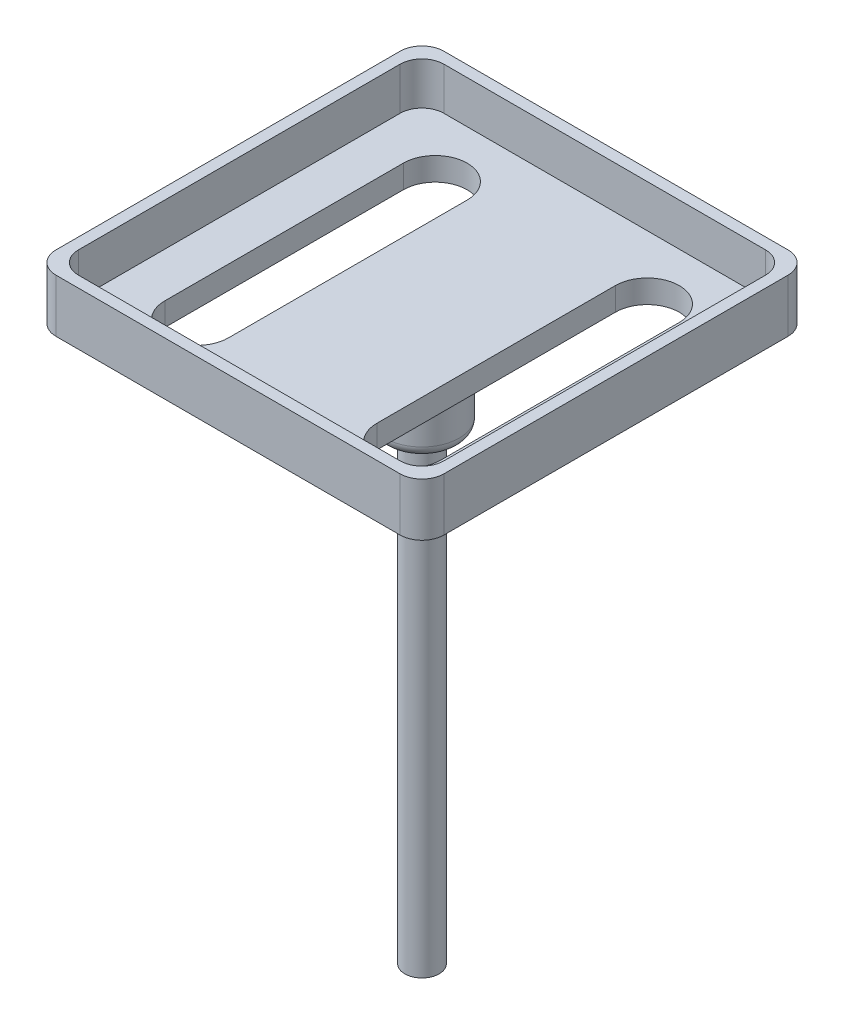
ISO-10303-21;
HEADER;
FILE_DESCRIPTION(('STEP AP214'),'2;1');
FILE_NAME('part.step','',(''),(''),'','','');
FILE_SCHEMA(('AUTOMOTIVE_DESIGN { 1 0 10303 214 1 1 1 1 }'));
ENDSEC;
DATA;
#1=APPLICATION_CONTEXT('core data for automotive mechanical design processes');
#2=APPLICATION_PROTOCOL_DEFINITION('international standard','automotive_design',2000,#1);
#3=PRODUCT_CONTEXT('',#1,'mechanical');
#4=PRODUCT('Part','Part','',(#3));
#5=PRODUCT_RELATED_PRODUCT_CATEGORY('part','',(#4));
#6=PRODUCT_DEFINITION_FORMATION('','',#4);
#7=PRODUCT_DEFINITION_CONTEXT('part definition',#1,'design');
#8=PRODUCT_DEFINITION('design','',#6,#7);
#9=PRODUCT_DEFINITION_SHAPE('','',#8);
#10=(LENGTH_UNIT() NAMED_UNIT(*) SI_UNIT(.MILLI.,.METRE.));
#11=(NAMED_UNIT(*) PLANE_ANGLE_UNIT() SI_UNIT($,.RADIAN.));
#12=(NAMED_UNIT(*) SI_UNIT($,.STERADIAN.) SOLID_ANGLE_UNIT());
#13=UNCERTAINTY_MEASURE_WITH_UNIT(LENGTH_MEASURE(1.E-05),#10,'distance_accuracy_value','');
#14=(GEOMETRIC_REPRESENTATION_CONTEXT(3) GLOBAL_UNCERTAINTY_ASSIGNED_CONTEXT((#13)) GLOBAL_UNIT_ASSIGNED_CONTEXT((#10,
#11,#12)) REPRESENTATION_CONTEXT('',''));
#15=CARTESIAN_POINT('',(0.,0.,0.));
#16=DIRECTION('',(0.,0.,1.));
#17=DIRECTION('',(1.,0.,0.));
#18=AXIS2_PLACEMENT_3D('',#15,#16,#17);
#19=CARTESIAN_POINT('',(0.,62.8904,0.));
#20=DIRECTION('',(0.,1.,0.));
#21=DIRECTION('',(0.,0.,1.));
#22=AXIS2_PLACEMENT_3D('',#19,#20,#21);
#23=PLANE('',#22);
#24=DIRECTION('',(-1.,0.,0.));
#25=VECTOR('',#24,1.);
#26=CARTESIAN_POINT('',(0.,62.8904,19.97075));
#27=LINE('',#26,#25);
#28=CARTESIAN_POINT('',(19.97075,62.8904,19.97075));
#29=VERTEX_POINT('',#28);
#30=CARTESIAN_POINT('',(-19.97075,62.8904,19.97075));
#31=VERTEX_POINT('',#30);
#32=EDGE_CURVE('E371',#29,#31,#27,.T.);
#33=ORIENTED_EDGE('',*,*,#32,.T.);
#34=DIRECTION('',(0.,0.,-1.));
#35=VECTOR('',#34,1.);
#36=CARTESIAN_POINT('',(-19.97075,62.8904,-19.97075));
#37=LINE('',#36,#35);
#38=CARTESIAN_POINT('',(-19.97075,62.8904,-19.97075));
#39=VERTEX_POINT('',#38);
#40=EDGE_CURVE('E373',#31,#39,#37,.T.);
#41=ORIENTED_EDGE('',*,*,#40,.T.);
#42=DIRECTION('',(1.,0.,0.));
#43=VECTOR('',#42,1.);
#44=CARTESIAN_POINT('',(19.97075,62.8904,-19.97075));
#45=LINE('',#44,#43);
#46=CARTESIAN_POINT('',(19.97075,62.8904,-19.97075));
#47=VERTEX_POINT('',#46);
#48=EDGE_CURVE('E367',#39,#47,#45,.T.);
#49=ORIENTED_EDGE('',*,*,#48,.T.);
#50=DIRECTION('',(0.,0.,1.));
#51=VECTOR('',#50,1.);
#52=CARTESIAN_POINT('',(19.97075,62.8904,0.));
#53=LINE('',#52,#51);
#54=EDGE_CURVE('E369',#47,#29,#53,.T.);
#55=ORIENTED_EDGE('',*,*,#54,.T.);
#56=EDGE_LOOP('',(#33,#41,#49,#55));
#57=FACE_BOUND('',#56,.T.);
#58=CARTESIAN_POINT('',(0.,62.8904,0.));
#59=DIRECTION('',(0.,1.,0.));
#60=DIRECTION('',(0.,0.,1.));
#61=AXIS2_PLACEMENT_3D('',#58,#59,#60);
#62=CIRCLE('',#61,6.858);
#63=CARTESIAN_POINT('',(0.,62.8904,6.858));
#64=VERTEX_POINT('',#63);
#65=EDGE_CURVE('E358',#64,#64,#62,.T.);
#66=ORIENTED_EDGE('',*,*,#65,.T.);
#67=EDGE_LOOP('',(#66));
#68=FACE_BOUND('',#67,.T.);
#69=CARTESIAN_POINT('',(-12.3063,62.8904,13.843));
#70=DIRECTION('',(0.,1.,0.));
#71=DIRECTION('',(0.,0.,1.));
#72=AXIS2_PLACEMENT_3D('',#69,#70,#71);
#73=CIRCLE('',#72,3.70840000000001);
#74=CARTESIAN_POINT('',(-16.0147,62.8904,13.843));
#75=VERTEX_POINT('',#74);
#76=CARTESIAN_POINT('',(-8.5979,62.8904,13.843));
#77=VERTEX_POINT('',#76);
#78=EDGE_CURVE('E212',#75,#77,#73,.T.);
#79=ORIENTED_EDGE('',*,*,#78,.T.);
#80=DIRECTION('',(0.,0.,1.));
#81=VECTOR('',#80,1.);
#82=CARTESIAN_POINT('',(-8.5979,62.8904,0.));
#83=LINE('',#82,#81);
#84=CARTESIAN_POINT('',(-8.5979,62.8904,-13.843));
#85=VERTEX_POINT('',#84);
#86=EDGE_CURVE('E257',#85,#77,#83,.T.);
#87=ORIENTED_EDGE('',*,*,#86,.F.);
#88=CARTESIAN_POINT('',(-12.3063,62.8904,-13.843));
#89=DIRECTION('',(0.,1.,0.));
#90=DIRECTION('',(0.,0.,1.));
#91=AXIS2_PLACEMENT_3D('',#88,#89,#90);
#92=CIRCLE('',#91,3.7084);
#93=CARTESIAN_POINT('',(-16.0147,62.8904,-13.843));
#94=VERTEX_POINT('',#93);
#95=EDGE_CURVE('E254',#85,#94,#92,.T.);
#96=ORIENTED_EDGE('',*,*,#95,.T.);
#97=DIRECTION('',(0.,0.,1.));
#98=VECTOR('',#97,1.);
#99=CARTESIAN_POINT('',(-16.0147,62.8904,0.));
#100=LINE('',#99,#98);
#101=EDGE_CURVE('E251',#94,#75,#100,.T.);
#102=ORIENTED_EDGE('',*,*,#101,.T.);
#103=EDGE_LOOP('',(#79,#87,#96,#102));
#104=FACE_BOUND('',#103,.T.);
#105=DIRECTION('',(0.,0.,1.));
#106=VECTOR('',#105,1.);
#107=CARTESIAN_POINT('',(16.0147,62.8904,0.));
#108=LINE('',#107,#106);
#109=CARTESIAN_POINT('',(16.0147,62.8904,-13.843));
#110=VERTEX_POINT('',#109);
#111=CARTESIAN_POINT('',(16.0147,62.8904,13.843));
#112=VERTEX_POINT('',#111);
#113=EDGE_CURVE('E260',#110,#112,#108,.T.);
#114=ORIENTED_EDGE('',*,*,#113,.F.);
#115=CARTESIAN_POINT('',(12.3063,62.8904,-13.843));
#116=DIRECTION('',(0.,1.,0.));
#117=DIRECTION('',(0.,0.,1.));
#118=AXIS2_PLACEMENT_3D('',#115,#116,#117);
#119=CIRCLE('',#118,3.7084);
#120=CARTESIAN_POINT('',(8.5979,62.8904,-13.843));
#121=VERTEX_POINT('',#120);
#122=EDGE_CURVE('E269',#121,#110,#119,.F.);
#123=ORIENTED_EDGE('',*,*,#122,.F.);
#124=DIRECTION('',(0.,0.,1.));
#125=VECTOR('',#124,1.);
#126=CARTESIAN_POINT('',(8.5979,62.8904,0.));
#127=LINE('',#126,#125);
#128=CARTESIAN_POINT('',(8.5979,62.8904,13.843));
#129=VERTEX_POINT('',#128);
#130=EDGE_CURVE('E266',#121,#129,#127,.T.);
#131=ORIENTED_EDGE('',*,*,#130,.T.);
#132=CARTESIAN_POINT('',(12.3063,62.8904,13.843));
#133=DIRECTION('',(0.,1.,0.));
#134=DIRECTION('',(0.,0.,1.));
#135=AXIS2_PLACEMENT_3D('',#132,#133,#134);
#136=CIRCLE('',#135,3.70840000000001);
#137=EDGE_CURVE('E263',#112,#129,#136,.F.);
#138=ORIENTED_EDGE('',*,*,#137,.F.);
#139=EDGE_LOOP('',(#114,#123,#131,#138));
#140=FACE_BOUND('',#139,.T.);
#141=ADVANCED_FACE('F33',(#57,#68,#104,#140),#23,.F.);
#142=CARTESIAN_POINT('',(16.0147,65.5701,0.));
#143=DIRECTION('',(1.,0.,0.));
#144=DIRECTION('',(0.,0.,-1.));
#145=AXIS2_PLACEMENT_3D('',#142,#143,#144);
#146=PLANE('',#145);
#147=ORIENTED_EDGE('',*,*,#113,.T.);
#148=DIRECTION('',(0.,-1.,0.));
#149=VECTOR('',#148,1.);
#150=CARTESIAN_POINT('',(16.0147,65.5701,13.843));
#151=LINE('',#150,#149);
#152=CARTESIAN_POINT('',(16.0147,65.5701,13.843));
#153=VERTEX_POINT('',#152);
#154=EDGE_CURVE('E278',#153,#112,#151,.T.);
#155=ORIENTED_EDGE('',*,*,#154,.F.);
#156=DIRECTION('',(0.,0.,1.));
#157=VECTOR('',#156,1.);
#158=CARTESIAN_POINT('',(16.0147,65.5701,0.));
#159=LINE('',#158,#157);
#160=CARTESIAN_POINT('',(16.0147,65.5701,-13.843));
#161=VERTEX_POINT('',#160);
#162=EDGE_CURVE('E239',#161,#153,#159,.T.);
#163=ORIENTED_EDGE('',*,*,#162,.F.);
#164=DIRECTION('',(0.,-1.,0.));
#165=VECTOR('',#164,1.);
#166=CARTESIAN_POINT('',(16.0147,65.5701,-13.843));
#167=LINE('',#166,#165);
#168=EDGE_CURVE('E217',#161,#110,#167,.T.);
#169=ORIENTED_EDGE('',*,*,#168,.T.);
#170=EDGE_LOOP('',(#147,#155,#163,#169));
#171=FACE_BOUND('',#170,.T.);
#172=ADVANCED_FACE('F514',(#171),#146,.F.);
#173=CARTESIAN_POINT('',(12.3063,65.5701,13.843));
#174=DIRECTION('',(0.,-1.,0.));
#175=DIRECTION('',(0.,0.,-1.));
#176=AXIS2_PLACEMENT_3D('',#173,#174,#175);
#177=CYLINDRICAL_SURFACE('',#176,3.70840000000001);
#178=ORIENTED_EDGE('',*,*,#137,.T.);
#179=DIRECTION('',(0.,-1.,0.));
#180=VECTOR('',#179,1.);
#181=CARTESIAN_POINT('',(8.5979,65.5701,13.843));
#182=LINE('',#181,#180);
#183=CARTESIAN_POINT('',(8.5979,65.5701,13.843));
#184=VERTEX_POINT('',#183);
#185=EDGE_CURVE('E276',#184,#129,#182,.T.);
#186=ORIENTED_EDGE('',*,*,#185,.F.);
#187=CARTESIAN_POINT('',(12.3063,65.5701,13.843));
#188=DIRECTION('',(0.,1.,0.));
#189=DIRECTION('',(0.,0.,1.));
#190=AXIS2_PLACEMENT_3D('',#187,#188,#189);
#191=CIRCLE('',#190,3.70840000000001);
#192=EDGE_CURVE('E242',#153,#184,#191,.F.);
#193=ORIENTED_EDGE('',*,*,#192,.F.);
#194=ORIENTED_EDGE('',*,*,#154,.T.);
#195=EDGE_LOOP('',(#178,#186,#193,#194));
#196=FACE_BOUND('',#195,.T.);
#197=ADVANCED_FACE('F519',(#196),#177,.F.);
#198=CARTESIAN_POINT('',(8.5979,65.5701,0.));
#199=DIRECTION('',(1.,0.,0.));
#200=DIRECTION('',(0.,0.,-1.));
#201=AXIS2_PLACEMENT_3D('',#198,#199,#200);
#202=PLANE('',#201);
#203=ORIENTED_EDGE('',*,*,#130,.F.);
#204=DIRECTION('',(0.,-1.,0.));
#205=VECTOR('',#204,1.);
#206=CARTESIAN_POINT('',(8.5979,65.5701,-13.843));
#207=LINE('',#206,#205);
#208=CARTESIAN_POINT('',(8.5979,65.5701,-13.843));
#209=VERTEX_POINT('',#208);
#210=EDGE_CURVE('E274',#209,#121,#207,.T.);
#211=ORIENTED_EDGE('',*,*,#210,.F.);
#212=DIRECTION('',(0.,0.,1.));
#213=VECTOR('',#212,1.);
#214=CARTESIAN_POINT('',(8.5979,65.5701,0.));
#215=LINE('',#214,#213);
#216=EDGE_CURVE('E244',#209,#184,#215,.T.);
#217=ORIENTED_EDGE('',*,*,#216,.T.);
#218=ORIENTED_EDGE('',*,*,#185,.T.);
#219=EDGE_LOOP('',(#203,#211,#217,#218));
#220=FACE_BOUND('',#219,.T.);
#221=ADVANCED_FACE('F524',(#220),#202,.T.);
#222=CARTESIAN_POINT('',(-12.3063,65.5701,13.843));
#223=DIRECTION('',(0.,-1.,0.));
#224=DIRECTION('',(0.,0.,-1.));
#225=AXIS2_PLACEMENT_3D('',#222,#223,#224);
#226=CYLINDRICAL_SURFACE('',#225,3.70840000000001);
#227=ORIENTED_EDGE('',*,*,#78,.F.);
#228=DIRECTION('',(0.,-1.,0.));
#229=VECTOR('',#228,1.);
#230=CARTESIAN_POINT('',(-16.0147,65.5701,13.843));
#231=LINE('',#230,#229);
#232=CARTESIAN_POINT('',(-16.0147,65.5701,13.843));
#233=VERTEX_POINT('',#232);
#234=EDGE_CURVE('E207',#233,#75,#231,.T.);
#235=ORIENTED_EDGE('',*,*,#234,.F.);
#236=CARTESIAN_POINT('',(-12.3063,65.5701,13.843));
#237=DIRECTION('',(0.,1.,0.));
#238=DIRECTION('',(0.,0.,1.));
#239=AXIS2_PLACEMENT_3D('',#236,#237,#238);
#240=CIRCLE('',#239,3.70840000000001);
#241=CARTESIAN_POINT('',(-8.5979,65.5701,13.843));
#242=VERTEX_POINT('',#241);
#243=EDGE_CURVE('E210',#233,#242,#240,.T.);
#244=ORIENTED_EDGE('',*,*,#243,.T.);
#245=DIRECTION('',(0.,-1.,0.));
#246=VECTOR('',#245,1.);
#247=CARTESIAN_POINT('',(-8.5979,65.5701,13.843));
#248=LINE('',#247,#246);
#249=EDGE_CURVE('E249',#242,#77,#248,.T.);
#250=ORIENTED_EDGE('',*,*,#249,.T.);
#251=EDGE_LOOP('',(#227,#235,#244,#250));
#252=FACE_BOUND('',#251,.T.);
#253=ADVANCED_FACE('F209',(#252),#226,.F.);
#254=CARTESIAN_POINT('',(-16.0147,65.5701,0.));
#255=DIRECTION('',(1.,0.,0.));
#256=DIRECTION('',(0.,0.,-1.));
#257=AXIS2_PLACEMENT_3D('',#254,#255,#256);
#258=PLANE('',#257);
#259=ORIENTED_EDGE('',*,*,#101,.F.);
#260=DIRECTION('',(0.,-1.,0.));
#261=VECTOR('',#260,1.);
#262=CARTESIAN_POINT('',(-16.0147,65.5701,-13.843));
#263=LINE('',#262,#261);
#264=CARTESIAN_POINT('',(-16.0147,65.5701,-13.843));
#265=VERTEX_POINT('',#264);
#266=EDGE_CURVE('E218',#265,#94,#263,.T.);
#267=ORIENTED_EDGE('',*,*,#266,.F.);
#268=DIRECTION('',(0.,0.,1.));
#269=VECTOR('',#268,1.);
#270=CARTESIAN_POINT('',(-16.0147,65.5701,0.));
#271=LINE('',#270,#269);
#272=EDGE_CURVE('E225',#265,#233,#271,.T.);
#273=ORIENTED_EDGE('',*,*,#272,.T.);
#274=ORIENTED_EDGE('',*,*,#234,.T.);
#275=EDGE_LOOP('',(#259,#267,#273,#274));
#276=FACE_BOUND('',#275,.T.);
#277=ADVANCED_FACE('F232',(#276),#258,.T.);
#278=CARTESIAN_POINT('',(-12.3063,65.5701,-13.843));
#279=DIRECTION('',(0.,-1.,0.));
#280=DIRECTION('',(0.,0.,-1.));
#281=AXIS2_PLACEMENT_3D('',#278,#279,#280);
#282=CYLINDRICAL_SURFACE('',#281,3.7084);
#283=ORIENTED_EDGE('',*,*,#95,.F.);
#284=DIRECTION('',(0.,-1.,0.));
#285=VECTOR('',#284,1.);
#286=CARTESIAN_POINT('',(-8.5979,65.5701,-13.843));
#287=LINE('',#286,#285);
#288=CARTESIAN_POINT('',(-8.5979,65.5701,-13.843));
#289=VERTEX_POINT('',#288);
#290=EDGE_CURVE('E283',#289,#85,#287,.T.);
#291=ORIENTED_EDGE('',*,*,#290,.F.);
#292=CARTESIAN_POINT('',(-12.3063,65.5701,-13.843));
#293=DIRECTION('',(0.,1.,0.));
#294=DIRECTION('',(0.,0.,1.));
#295=AXIS2_PLACEMENT_3D('',#292,#293,#294);
#296=CIRCLE('',#295,3.7084);
#297=EDGE_CURVE('E233',#289,#265,#296,.T.);
#298=ORIENTED_EDGE('',*,*,#297,.T.);
#299=ORIENTED_EDGE('',*,*,#266,.T.);
#300=EDGE_LOOP('',(#283,#291,#298,#299));
#301=FACE_BOUND('',#300,.T.);
#302=ADVANCED_FACE('F533',(#301),#282,.F.);
#303=CARTESIAN_POINT('',(-8.5979,65.5701,0.));
#304=DIRECTION('',(1.,0.,0.));
#305=DIRECTION('',(0.,0.,-1.));
#306=AXIS2_PLACEMENT_3D('',#303,#304,#305);
#307=PLANE('',#306);
#308=ORIENTED_EDGE('',*,*,#86,.T.);
#309=ORIENTED_EDGE('',*,*,#249,.F.);
#310=DIRECTION('',(0.,0.,1.));
#311=VECTOR('',#310,1.);
#312=CARTESIAN_POINT('',(-8.5979,65.5701,0.));
#313=LINE('',#312,#311);
#314=EDGE_CURVE('E228',#289,#242,#313,.T.);
#315=ORIENTED_EDGE('',*,*,#314,.F.);
#316=ORIENTED_EDGE('',*,*,#290,.T.);
#317=EDGE_LOOP('',(#308,#309,#315,#316));
#318=FACE_BOUND('',#317,.T.);
#319=ADVANCED_FACE('F508',(#318),#307,.F.);
#320=CARTESIAN_POINT('',(12.3063,65.5701,-13.843));
#321=DIRECTION('',(0.,-1.,0.));
#322=DIRECTION('',(0.,0.,-1.));
#323=AXIS2_PLACEMENT_3D('',#320,#321,#322);
#324=CYLINDRICAL_SURFACE('',#323,3.7084);
#325=ORIENTED_EDGE('',*,*,#122,.T.);
#326=ORIENTED_EDGE('',*,*,#168,.F.);
#327=CARTESIAN_POINT('',(12.3063,65.5701,-13.843));
#328=DIRECTION('',(0.,1.,0.));
#329=DIRECTION('',(0.,0.,1.));
#330=AXIS2_PLACEMENT_3D('',#327,#328,#329);
#331=CIRCLE('',#330,3.7084);
#332=EDGE_CURVE('E247',#209,#161,#331,.F.);
#333=ORIENTED_EDGE('',*,*,#332,.F.);
#334=ORIENTED_EDGE('',*,*,#210,.T.);
#335=EDGE_LOOP('',(#325,#326,#333,#334));
#336=FACE_BOUND('',#335,.T.);
#337=ADVANCED_FACE('F501',(#336),#324,.F.);
#338=CARTESIAN_POINT('',(0.,65.5701,0.));
#339=DIRECTION('',(0.,1.,0.));
#340=DIRECTION('',(0.,0.,1.));
#341=AXIS2_PLACEMENT_3D('',#338,#339,#340);
#342=PLANE('',#341);
#343=DIRECTION('',(1.,0.,0.));
#344=VECTOR('',#343,1.);
#345=CARTESIAN_POINT('',(0.,65.5701,21.209));
#346=LINE('',#345,#344);
#347=CARTESIAN_POINT('',(-18.669,65.5701,21.209));
#348=VERTEX_POINT('',#347);
#349=CARTESIAN_POINT('',(18.669,65.5701,21.209));
#350=VERTEX_POINT('',#349);
#351=EDGE_CURVE('E457',#348,#350,#346,.T.);
#352=ORIENTED_EDGE('',*,*,#351,.T.);
#353=CARTESIAN_POINT('',(18.669,65.5701,18.669));
#354=DIRECTION('',(0.,1.,0.));
#355=DIRECTION('',(0.,0.,1.));
#356=AXIS2_PLACEMENT_3D('',#353,#354,#355);
#357=CIRCLE('',#356,2.54);
#358=CARTESIAN_POINT('',(21.209,65.5701,18.669));
#359=VERTEX_POINT('',#358);
#360=EDGE_CURVE('E299',#350,#359,#357,.T.);
#361=ORIENTED_EDGE('',*,*,#360,.T.);
#362=DIRECTION('',(0.,0.,-1.));
#363=VECTOR('',#362,1.);
#364=CARTESIAN_POINT('',(21.209,65.5701,0.));
#365=LINE('',#364,#363);
#366=CARTESIAN_POINT('',(21.209,65.5701,-18.669));
#367=VERTEX_POINT('',#366);
#368=EDGE_CURVE('E460',#359,#367,#365,.T.);
#369=ORIENTED_EDGE('',*,*,#368,.T.);
#370=CARTESIAN_POINT('',(18.669,65.5701,-18.669));
#371=DIRECTION('',(0.,1.,0.));
#372=DIRECTION('',(0.,0.,1.));
#373=AXIS2_PLACEMENT_3D('',#370,#371,#372);
#374=CIRCLE('',#373,2.54);
#375=CARTESIAN_POINT('',(18.669,65.5701,-21.209));
#376=VERTEX_POINT('',#375);
#377=EDGE_CURVE('E297',#367,#376,#374,.T.);
#378=ORIENTED_EDGE('',*,*,#377,.T.);
#379=DIRECTION('',(1.,0.,0.));
#380=VECTOR('',#379,1.);
#381=CARTESIAN_POINT('',(0.,65.5701,-21.209));
#382=LINE('',#381,#380);
#383=CARTESIAN_POINT('',(-18.669,65.5701,-21.209));
#384=VERTEX_POINT('',#383);
#385=EDGE_CURVE('E230',#384,#376,#382,.T.);
#386=ORIENTED_EDGE('',*,*,#385,.F.);
#387=CARTESIAN_POINT('',(-18.669,65.5701,-18.669));
#388=DIRECTION('',(0.,1.,0.));
#389=DIRECTION('',(0.,0.,1.));
#390=AXIS2_PLACEMENT_3D('',#387,#388,#389);
#391=CIRCLE('',#390,2.54);
#392=CARTESIAN_POINT('',(-21.209,65.5701,-18.669));
#393=VERTEX_POINT('',#392);
#394=EDGE_CURVE('E295',#384,#393,#391,.T.);
#395=ORIENTED_EDGE('',*,*,#394,.T.);
#396=DIRECTION('',(0.,0.,-1.));
#397=VECTOR('',#396,1.);
#398=CARTESIAN_POINT('',(-21.209,65.5701,0.));
#399=LINE('',#398,#397);
#400=CARTESIAN_POINT('',(-21.209,65.5701,18.669));
#401=VERTEX_POINT('',#400);
#402=EDGE_CURVE('E271',#401,#393,#399,.T.);
#403=ORIENTED_EDGE('',*,*,#402,.F.);
#404=CARTESIAN_POINT('',(-18.669,65.5701,18.669));
#405=DIRECTION('',(0.,1.,0.));
#406=DIRECTION('',(0.,0.,1.));
#407=AXIS2_PLACEMENT_3D('',#404,#405,#406);
#408=CIRCLE('',#407,2.54);
#409=EDGE_CURVE('E293',#401,#348,#408,.T.);
#410=ORIENTED_EDGE('',*,*,#409,.T.);
#411=EDGE_LOOP('',(#352,#361,#369,#378,#386,#395,#403,#410));
#412=FACE_BOUND('',#411,.T.);
#413=ORIENTED_EDGE('',*,*,#243,.F.);
#414=ORIENTED_EDGE('',*,*,#272,.F.);
#415=ORIENTED_EDGE('',*,*,#297,.F.);
#416=ORIENTED_EDGE('',*,*,#314,.T.);
#417=EDGE_LOOP('',(#413,#414,#415,#416));
#418=FACE_BOUND('',#417,.T.);
#419=ORIENTED_EDGE('',*,*,#162,.T.);
#420=ORIENTED_EDGE('',*,*,#192,.T.);
#421=ORIENTED_EDGE('',*,*,#216,.F.);
#422=ORIENTED_EDGE('',*,*,#332,.T.);
#423=EDGE_LOOP('',(#419,#420,#421,#422));
#424=FACE_BOUND('',#423,.T.);
#425=ADVANCED_FACE('F222',(#412,#418,#424),#342,.T.);
#426=CARTESIAN_POINT('',(0.,70.5104,21.209));
#427=DIRECTION('',(0.,0.,-1.));
#428=DIRECTION('',(-1.,0.,0.));
#429=AXIS2_PLACEMENT_3D('',#426,#427,#428);
#430=PLANE('',#429);
#431=DIRECTION('',(1.,0.,0.));
#432=VECTOR('',#431,1.);
#433=CARTESIAN_POINT('',(0.,70.5104,21.209));
#434=LINE('',#433,#432);
#435=CARTESIAN_POINT('',(-18.669,70.5104,21.209));
#436=VERTEX_POINT('',#435);
#437=CARTESIAN_POINT('',(18.669,70.5104,21.209));
#438=VERTEX_POINT('',#437);
#439=EDGE_CURVE('E440',#436,#438,#434,.T.);
#440=ORIENTED_EDGE('',*,*,#439,.T.);
#441=DIRECTION('',(0.,-1.,0.));
#442=VECTOR('',#441,1.);
#443=CARTESIAN_POINT('',(18.669,65.5701,21.209));
#444=LINE('',#443,#442);
#445=EDGE_CURVE('E290',#438,#350,#444,.T.);
#446=ORIENTED_EDGE('',*,*,#445,.T.);
#447=ORIENTED_EDGE('',*,*,#351,.F.);
#448=DIRECTION('',(0.,-1.,0.));
#449=VECTOR('',#448,1.);
#450=CARTESIAN_POINT('',(-18.669,70.5104,21.209));
#451=LINE('',#450,#449);
#452=EDGE_CURVE('E288',#348,#436,#451,.F.);
#453=ORIENTED_EDGE('',*,*,#452,.T.);
#454=EDGE_LOOP('',(#440,#446,#447,#453));
#455=FACE_BOUND('',#454,.T.);
#456=ADVANCED_FACE('F486',(#455),#430,.T.);
#457=CARTESIAN_POINT('',(-21.209,70.5104,0.));
#458=DIRECTION('',(-1.,0.,0.));
#459=DIRECTION('',(0.,0.,1.));
#460=AXIS2_PLACEMENT_3D('',#457,#458,#459);
#461=PLANE('',#460);
#462=ORIENTED_EDGE('',*,*,#402,.T.);
#463=DIRECTION('',(0.,-1.,0.));
#464=VECTOR('',#463,1.);
#465=CARTESIAN_POINT('',(-21.209,70.5104,-18.669));
#466=LINE('',#465,#464);
#467=CARTESIAN_POINT('',(-21.209,70.5104,-18.669));
#468=VERTEX_POINT('',#467);
#469=EDGE_CURVE('E314',#393,#468,#466,.F.);
#470=ORIENTED_EDGE('',*,*,#469,.T.);
#471=DIRECTION('',(0.,0.,-1.));
#472=VECTOR('',#471,1.);
#473=CARTESIAN_POINT('',(-21.209,70.5104,0.));
#474=LINE('',#473,#472);
#475=CARTESIAN_POINT('',(-21.209,70.5104,18.669));
#476=VERTEX_POINT('',#475);
#477=EDGE_CURVE('E447',#476,#468,#474,.T.);
#478=ORIENTED_EDGE('',*,*,#477,.F.);
#479=DIRECTION('',(0.,-1.,0.));
#480=VECTOR('',#479,1.);
#481=CARTESIAN_POINT('',(-21.209,70.5104,18.669));
#482=LINE('',#481,#480);
#483=EDGE_CURVE('E311',#476,#401,#482,.T.);
#484=ORIENTED_EDGE('',*,*,#483,.T.);
#485=EDGE_LOOP('',(#462,#470,#478,#484));
#486=FACE_BOUND('',#485,.T.);
#487=ADVANCED_FACE('F495',(#486),#461,.F.);
#488=CARTESIAN_POINT('',(0.,70.5104,-21.209));
#489=DIRECTION('',(0.,0.,-1.));
#490=DIRECTION('',(-1.,0.,0.));
#491=AXIS2_PLACEMENT_3D('',#488,#489,#490);
#492=PLANE('',#491);
#493=ORIENTED_EDGE('',*,*,#385,.T.);
#494=DIRECTION('',(0.,-1.,0.));
#495=VECTOR('',#494,1.);
#496=CARTESIAN_POINT('',(18.669,70.5104,-21.209));
#497=LINE('',#496,#495);
#498=CARTESIAN_POINT('',(18.669,70.5104,-21.209));
#499=VERTEX_POINT('',#498);
#500=EDGE_CURVE('E309',#376,#499,#497,.F.);
#501=ORIENTED_EDGE('',*,*,#500,.T.);
#502=DIRECTION('',(1.,0.,0.));
#503=VECTOR('',#502,1.);
#504=CARTESIAN_POINT('',(0.,70.5104,-21.209));
#505=LINE('',#504,#503);
#506=CARTESIAN_POINT('',(-18.669,70.5104,-21.209));
#507=VERTEX_POINT('',#506);
#508=EDGE_CURVE('E450',#507,#499,#505,.T.);
#509=ORIENTED_EDGE('',*,*,#508,.F.);
#510=DIRECTION('',(0.,-1.,0.));
#511=VECTOR('',#510,1.);
#512=CARTESIAN_POINT('',(-18.669,65.5701,-21.209));
#513=LINE('',#512,#511);
#514=EDGE_CURVE('E306',#507,#384,#513,.T.);
#515=ORIENTED_EDGE('',*,*,#514,.T.);
#516=EDGE_LOOP('',(#493,#501,#509,#515));
#517=FACE_BOUND('',#516,.T.);
#518=ADVANCED_FACE('F466',(#517),#492,.F.);
#519=CARTESIAN_POINT('',(0.,70.5104,22.51075));
#520=DIRECTION('',(0.,0.,-1.));
#521=DIRECTION('',(-1.,0.,0.));
#522=AXIS2_PLACEMENT_3D('',#519,#520,#521);
#523=PLANE('',#522);
#524=DIRECTION('',(0.,-1.,0.));
#525=VECTOR('',#524,1.);
#526=CARTESIAN_POINT('',(-19.97075,62.8904,22.51075));
#527=LINE('',#526,#525);
#528=CARTESIAN_POINT('',(-19.97075,70.5104,22.51075));
#529=VERTEX_POINT('',#528);
#530=CARTESIAN_POINT('',(-19.97075,64.3568696837417,22.51075));
#531=VERTEX_POINT('',#530);
#532=EDGE_CURVE('E318',#529,#531,#527,.T.);
#533=ORIENTED_EDGE('',*,*,#532,.T.);
#534=DIRECTION('',(1.,0.,0.));
#535=VECTOR('',#534,1.);
#536=CARTESIAN_POINT('',(0.,64.3568696837417,22.51075));
#537=LINE('',#536,#535);
#538=CARTESIAN_POINT('',(19.97075,64.3568696837417,22.51075));
#539=VERTEX_POINT('',#538);
#540=EDGE_CURVE('E379',#531,#539,#537,.T.);
#541=ORIENTED_EDGE('',*,*,#540,.T.);
#542=DIRECTION('',(0.,-1.,0.));
#543=VECTOR('',#542,1.);
#544=CARTESIAN_POINT('',(19.97075,70.5104,22.51075));
#545=LINE('',#544,#543);
#546=CARTESIAN_POINT('',(19.97075,70.5104,22.51075));
#547=VERTEX_POINT('',#546);
#548=EDGE_CURVE('E316',#539,#547,#545,.F.);
#549=ORIENTED_EDGE('',*,*,#548,.T.);
#550=DIRECTION('',(1.,0.,0.));
#551=VECTOR('',#550,1.);
#552=CARTESIAN_POINT('',(0.,70.5104,22.51075));
#553=LINE('',#552,#551);
#554=EDGE_CURVE('E355',#529,#547,#553,.T.);
#555=ORIENTED_EDGE('',*,*,#554,.F.);
#556=EDGE_LOOP('',(#533,#541,#549,#555));
#557=FACE_BOUND('',#556,.T.);
#558=ADVANCED_FACE('F706',(#557),#523,.F.);
#559=CARTESIAN_POINT('',(22.51075,70.5104,0.));
#560=DIRECTION('',(-1.,0.,0.));
#561=DIRECTION('',(0.,0.,1.));
#562=AXIS2_PLACEMENT_3D('',#559,#560,#561);
#563=PLANE('',#562);
#564=DIRECTION('',(0.,-1.,0.));
#565=VECTOR('',#564,1.);
#566=CARTESIAN_POINT('',(22.51075,70.5104,19.97075));
#567=LINE('',#566,#565);
#568=CARTESIAN_POINT('',(22.51075,70.5104,19.97075));
#569=VERTEX_POINT('',#568);
#570=CARTESIAN_POINT('',(22.51075,64.3568696837417,19.97075));
#571=VERTEX_POINT('',#570);
#572=EDGE_CURVE('E338',#569,#571,#567,.T.);
#573=ORIENTED_EDGE('',*,*,#572,.T.);
#574=DIRECTION('',(0.,0.,-1.));
#575=VECTOR('',#574,1.);
#576=CARTESIAN_POINT('',(22.51075,64.3568696837417,0.));
#577=LINE('',#576,#575);
#578=CARTESIAN_POINT('',(22.51075,64.3568696837417,-19.97075));
#579=VERTEX_POINT('',#578);
#580=EDGE_CURVE('E385',#571,#579,#577,.T.);
#581=ORIENTED_EDGE('',*,*,#580,.T.);
#582=DIRECTION('',(0.,-1.,0.));
#583=VECTOR('',#582,1.);
#584=CARTESIAN_POINT('',(22.51075,70.5104,-19.97075));
#585=LINE('',#584,#583);
#586=CARTESIAN_POINT('',(22.51075,70.5104,-19.97075));
#587=VERTEX_POINT('',#586);
#588=EDGE_CURVE('E341',#579,#587,#585,.F.);
#589=ORIENTED_EDGE('',*,*,#588,.T.);
#590=DIRECTION('',(0.,0.,-1.));
#591=VECTOR('',#590,1.);
#592=CARTESIAN_POINT('',(22.51075,70.5104,0.));
#593=LINE('',#592,#591);
#594=EDGE_CURVE('E435',#569,#587,#593,.T.);
#595=ORIENTED_EDGE('',*,*,#594,.F.);
#596=EDGE_LOOP('',(#573,#581,#589,#595));
#597=FACE_BOUND('',#596,.T.);
#598=ADVANCED_FACE('F421',(#597),#563,.F.);
#599=CARTESIAN_POINT('',(0.,70.5104,-22.51075));
#600=DIRECTION('',(0.,0.,-1.));
#601=DIRECTION('',(-1.,0.,0.));
#602=AXIS2_PLACEMENT_3D('',#599,#600,#601);
#603=PLANE('',#602);
#604=DIRECTION('',(0.,-1.,0.));
#605=VECTOR('',#604,1.);
#606=CARTESIAN_POINT('',(19.97075,62.8904,-22.51075));
#607=LINE('',#606,#605);
#608=CARTESIAN_POINT('',(19.97075,70.5104,-22.51075));
#609=VERTEX_POINT('',#608);
#610=CARTESIAN_POINT('',(19.97075,64.3568696837417,-22.51075));
#611=VERTEX_POINT('',#610);
#612=EDGE_CURVE('E336',#609,#611,#607,.T.);
#613=ORIENTED_EDGE('',*,*,#612,.T.);
#614=DIRECTION('',(-1.,0.,0.));
#615=VECTOR('',#614,1.);
#616=CARTESIAN_POINT('',(-19.97075,64.3568696837417,-22.51075));
#617=LINE('',#616,#615);
#618=CARTESIAN_POINT('',(-19.97075,64.3568696837417,-22.51075));
#619=VERTEX_POINT('',#618);
#620=EDGE_CURVE('E11',#611,#619,#617,.T.);
#621=ORIENTED_EDGE('',*,*,#620,.T.);
#622=DIRECTION('',(0.,-1.,0.));
#623=VECTOR('',#622,1.);
#624=CARTESIAN_POINT('',(-19.97075,70.5104,-22.51075));
#625=LINE('',#624,#623);
#626=CARTESIAN_POINT('',(-19.97075,70.5104,-22.51075));
#627=VERTEX_POINT('',#626);
#628=EDGE_CURVE('E334',#619,#627,#625,.F.);
#629=ORIENTED_EDGE('',*,*,#628,.T.);
#630=DIRECTION('',(1.,0.,0.));
#631=VECTOR('',#630,1.);
#632=CARTESIAN_POINT('',(0.,70.5104,-22.51075));
#633=LINE('',#632,#631);
#634=EDGE_CURVE('E433',#627,#609,#633,.T.);
#635=ORIENTED_EDGE('',*,*,#634,.T.);
#636=EDGE_LOOP('',(#613,#621,#629,#635));
#637=FACE_BOUND('',#636,.T.);
#638=ADVANCED_FACE('F436',(#637),#603,.T.);
#639=CARTESIAN_POINT('',(-22.51075,70.5104,0.));
#640=DIRECTION('',(-1.,0.,0.));
#641=DIRECTION('',(0.,0.,1.));
#642=AXIS2_PLACEMENT_3D('',#639,#640,#641);
#643=PLANE('',#642);
#644=DIRECTION('',(0.,-1.,0.));
#645=VECTOR('',#644,1.);
#646=CARTESIAN_POINT('',(-22.51075,70.5104,-19.97075));
#647=LINE('',#646,#645);
#648=CARTESIAN_POINT('',(-22.51075,70.5104,-19.97075));
#649=VERTEX_POINT('',#648);
#650=CARTESIAN_POINT('',(-22.51075,64.3568696837417,-19.97075));
#651=VERTEX_POINT('',#650);
#652=EDGE_CURVE('E321',#649,#651,#647,.T.);
#653=ORIENTED_EDGE('',*,*,#652,.T.);
#654=DIRECTION('',(0.,0.,1.));
#655=VECTOR('',#654,1.);
#656=CARTESIAN_POINT('',(-22.51075,64.3568696837417,19.97075));
#657=LINE('',#656,#655);
#658=CARTESIAN_POINT('',(-22.51075,64.3568696837417,19.97075));
#659=VERTEX_POINT('',#658);
#660=EDGE_CURVE('E376',#651,#659,#657,.T.);
#661=ORIENTED_EDGE('',*,*,#660,.T.);
#662=DIRECTION('',(0.,-1.,0.));
#663=VECTOR('',#662,1.);
#664=CARTESIAN_POINT('',(-22.51075,70.5104,19.97075));
#665=LINE('',#664,#663);
#666=CARTESIAN_POINT('',(-22.51075,70.5104,19.97075));
#667=VERTEX_POINT('',#666);
#668=EDGE_CURVE('E324',#659,#667,#665,.F.);
#669=ORIENTED_EDGE('',*,*,#668,.T.);
#670=DIRECTION('',(0.,0.,-1.));
#671=VECTOR('',#670,1.);
#672=CARTESIAN_POINT('',(-22.51075,70.5104,0.));
#673=LINE('',#672,#671);
#674=EDGE_CURVE('E437',#667,#649,#673,.T.);
#675=ORIENTED_EDGE('',*,*,#674,.T.);
#676=EDGE_LOOP('',(#653,#661,#669,#675));
#677=FACE_BOUND('',#676,.T.);
#678=ADVANCED_FACE('F686',(#677),#643,.T.);
#679=CARTESIAN_POINT('',(21.209,70.5104,0.));
#680=DIRECTION('',(-1.,0.,0.));
#681=DIRECTION('',(0.,0.,1.));
#682=AXIS2_PLACEMENT_3D('',#679,#680,#681);
#683=PLANE('',#682);
#684=ORIENTED_EDGE('',*,*,#368,.F.);
#685=DIRECTION('',(0.,-1.,0.));
#686=VECTOR('',#685,1.);
#687=CARTESIAN_POINT('',(21.209,70.5104,18.669));
#688=LINE('',#687,#686);
#689=CARTESIAN_POINT('',(21.209,70.5104,18.669));
#690=VERTEX_POINT('',#689);
#691=EDGE_CURVE('E304',#359,#690,#688,.F.);
#692=ORIENTED_EDGE('',*,*,#691,.T.);
#693=DIRECTION('',(0.,0.,-1.));
#694=VECTOR('',#693,1.);
#695=CARTESIAN_POINT('',(21.209,70.5104,0.));
#696=LINE('',#695,#694);
#697=CARTESIAN_POINT('',(21.209,70.5104,-18.669));
#698=VERTEX_POINT('',#697);
#699=EDGE_CURVE('E252',#690,#698,#696,.T.);
#700=ORIENTED_EDGE('',*,*,#699,.T.);
#701=DIRECTION('',(0.,-1.,0.));
#702=VECTOR('',#701,1.);
#703=CARTESIAN_POINT('',(21.209,70.5104,-18.669));
#704=LINE('',#703,#702);
#705=EDGE_CURVE('E301',#698,#367,#704,.T.);
#706=ORIENTED_EDGE('',*,*,#705,.T.);
#707=EDGE_LOOP('',(#684,#692,#700,#706));
#708=FACE_BOUND('',#707,.T.);
#709=ADVANCED_FACE('F479',(#708),#683,.T.);
#710=CARTESIAN_POINT('',(0.,70.5104,0.));
#711=DIRECTION('',(0.,1.,0.));
#712=DIRECTION('',(0.,0.,1.));
#713=AXIS2_PLACEMENT_3D('',#710,#711,#712);
#714=PLANE('',#713);
#715=ORIENTED_EDGE('',*,*,#674,.F.);
#716=CARTESIAN_POINT('',(-19.97075,70.5104,19.97075));
#717=DIRECTION('',(0.,1.,0.));
#718=DIRECTION('',(0.,0.,1.));
#719=AXIS2_PLACEMENT_3D('',#716,#717,#718);
#720=CIRCLE('',#719,2.54);
#721=EDGE_CURVE('E332',#667,#529,#720,.T.);
#722=ORIENTED_EDGE('',*,*,#721,.T.);
#723=ORIENTED_EDGE('',*,*,#554,.T.);
#724=CARTESIAN_POINT('',(19.97075,70.5104,19.97075));
#725=DIRECTION('',(0.,1.,0.));
#726=DIRECTION('',(0.,0.,1.));
#727=AXIS2_PLACEMENT_3D('',#724,#725,#726);
#728=CIRCLE('',#727,2.54);
#729=EDGE_CURVE('E328',#547,#569,#728,.T.);
#730=ORIENTED_EDGE('',*,*,#729,.T.);
#731=ORIENTED_EDGE('',*,*,#594,.T.);
#732=CARTESIAN_POINT('',(19.97075,70.5104,-19.97075));
#733=DIRECTION('',(0.,1.,0.));
#734=DIRECTION('',(0.,0.,1.));
#735=AXIS2_PLACEMENT_3D('',#732,#733,#734);
#736=CIRCLE('',#735,2.54);
#737=EDGE_CURVE('E330',#587,#609,#736,.T.);
#738=ORIENTED_EDGE('',*,*,#737,.T.);
#739=ORIENTED_EDGE('',*,*,#634,.F.);
#740=CARTESIAN_POINT('',(-19.97075,70.5104,-19.97075));
#741=DIRECTION('',(0.,1.,0.));
#742=DIRECTION('',(0.,0.,1.));
#743=AXIS2_PLACEMENT_3D('',#740,#741,#742);
#744=CIRCLE('',#743,2.54);
#745=EDGE_CURVE('E326',#627,#649,#744,.T.);
#746=ORIENTED_EDGE('',*,*,#745,.T.);
#747=EDGE_LOOP('',(#715,#722,#723,#730,#731,#738,#739,#746));
#748=FACE_BOUND('',#747,.T.);
#749=ORIENTED_EDGE('',*,*,#439,.F.);
#750=CARTESIAN_POINT('',(-18.669,70.5104,18.669));
#751=DIRECTION('',(0.,1.,0.));
#752=DIRECTION('',(0.,0.,1.));
#753=AXIS2_PLACEMENT_3D('',#750,#751,#752);
#754=CIRCLE('',#753,2.54);
#755=EDGE_CURVE('E349',#436,#476,#754,.F.);
#756=ORIENTED_EDGE('',*,*,#755,.T.);
#757=ORIENTED_EDGE('',*,*,#477,.T.);
#758=CARTESIAN_POINT('',(-18.669,70.5104,-18.669));
#759=DIRECTION('',(0.,1.,0.));
#760=DIRECTION('',(0.,0.,1.));
#761=AXIS2_PLACEMENT_3D('',#758,#759,#760);
#762=CIRCLE('',#761,2.54);
#763=EDGE_CURVE('E347',#468,#507,#762,.F.);
#764=ORIENTED_EDGE('',*,*,#763,.T.);
#765=ORIENTED_EDGE('',*,*,#508,.T.);
#766=CARTESIAN_POINT('',(18.669,70.5104,-18.669));
#767=DIRECTION('',(0.,1.,0.));
#768=DIRECTION('',(0.,0.,1.));
#769=AXIS2_PLACEMENT_3D('',#766,#767,#768);
#770=CIRCLE('',#769,2.54);
#771=EDGE_CURVE('E345',#499,#698,#770,.F.);
#772=ORIENTED_EDGE('',*,*,#771,.T.);
#773=ORIENTED_EDGE('',*,*,#699,.F.);
#774=CARTESIAN_POINT('',(18.669,70.5104,18.669));
#775=DIRECTION('',(0.,1.,0.));
#776=DIRECTION('',(0.,0.,1.));
#777=AXIS2_PLACEMENT_3D('',#774,#775,#776);
#778=CIRCLE('',#777,2.54);
#779=EDGE_CURVE('E343',#690,#438,#778,.F.);
#780=ORIENTED_EDGE('',*,*,#779,.T.);
#781=EDGE_LOOP('',(#749,#756,#757,#764,#765,#772,#773,#780));
#782=FACE_BOUND('',#781,.T.);
#783=ADVANCED_FACE('F431',(#748,#782),#714,.T.);
#784=CARTESIAN_POINT('',(18.669,70.5104,18.669));
#785=DIRECTION('',(0.,1.,0.));
#786=DIRECTION('',(0.,0.,1.));
#787=AXIS2_PLACEMENT_3D('',#784,#785,#786);
#788=CYLINDRICAL_SURFACE('',#787,2.54);
#789=ORIENTED_EDGE('',*,*,#779,.F.);
#790=ORIENTED_EDGE('',*,*,#691,.F.);
#791=ORIENTED_EDGE('',*,*,#360,.F.);
#792=ORIENTED_EDGE('',*,*,#445,.F.);
#793=EDGE_LOOP('',(#789,#790,#791,#792));
#794=FACE_BOUND('',#793,.T.);
#795=ADVANCED_FACE('F482',(#794),#788,.F.);
#796=CARTESIAN_POINT('',(18.669,70.5104,-18.669));
#797=DIRECTION('',(0.,-1.,0.));
#798=DIRECTION('',(0.,0.,-1.));
#799=AXIS2_PLACEMENT_3D('',#796,#797,#798);
#800=CYLINDRICAL_SURFACE('',#799,2.54);
#801=ORIENTED_EDGE('',*,*,#771,.F.);
#802=ORIENTED_EDGE('',*,*,#500,.F.);
#803=ORIENTED_EDGE('',*,*,#377,.F.);
#804=ORIENTED_EDGE('',*,*,#705,.F.);
#805=EDGE_LOOP('',(#801,#802,#803,#804));
#806=FACE_BOUND('',#805,.T.);
#807=ADVANCED_FACE('F472',(#806),#800,.F.);
#808=CARTESIAN_POINT('',(-18.669,70.5104,-18.669));
#809=DIRECTION('',(0.,1.,0.));
#810=DIRECTION('',(0.,0.,1.));
#811=AXIS2_PLACEMENT_3D('',#808,#809,#810);
#812=CYLINDRICAL_SURFACE('',#811,2.54);
#813=ORIENTED_EDGE('',*,*,#763,.F.);
#814=ORIENTED_EDGE('',*,*,#469,.F.);
#815=ORIENTED_EDGE('',*,*,#394,.F.);
#816=ORIENTED_EDGE('',*,*,#514,.F.);
#817=EDGE_LOOP('',(#813,#814,#815,#816));
#818=FACE_BOUND('',#817,.T.);
#819=ADVANCED_FACE('F499',(#818),#812,.F.);
#820=CARTESIAN_POINT('',(-18.669,70.5104,18.669));
#821=DIRECTION('',(0.,-1.,0.));
#822=DIRECTION('',(0.,0.,-1.));
#823=AXIS2_PLACEMENT_3D('',#820,#821,#822);
#824=CYLINDRICAL_SURFACE('',#823,2.54);
#825=ORIENTED_EDGE('',*,*,#755,.F.);
#826=ORIENTED_EDGE('',*,*,#452,.F.);
#827=ORIENTED_EDGE('',*,*,#409,.F.);
#828=ORIENTED_EDGE('',*,*,#483,.F.);
#829=EDGE_LOOP('',(#825,#826,#827,#828));
#830=FACE_BOUND('',#829,.T.);
#831=ADVANCED_FACE('F490',(#830),#824,.F.);
#832=CARTESIAN_POINT('',(-19.97075,70.5104,19.97075));
#833=DIRECTION('',(0.,1.,0.));
#834=DIRECTION('',(0.,0.,1.));
#835=AXIS2_PLACEMENT_3D('',#832,#833,#834);
#836=CYLINDRICAL_SURFACE('',#835,2.54);
#837=ORIENTED_EDGE('',*,*,#668,.F.);
#838=CARTESIAN_POINT('',(-19.97075,64.3568696837417,19.97075));
#839=DIRECTION('',(0.,1.,0.));
#840=DIRECTION('',(0.,0.,1.));
#841=AXIS2_PLACEMENT_3D('',#838,#839,#840);
#842=CIRCLE('',#841,2.54);
#843=EDGE_CURVE('E381',#659,#531,#842,.T.);
#844=ORIENTED_EDGE('',*,*,#843,.T.);
#845=ORIENTED_EDGE('',*,*,#532,.F.);
#846=ORIENTED_EDGE('',*,*,#721,.F.);
#847=EDGE_LOOP('',(#837,#844,#845,#846));
#848=FACE_BOUND('',#847,.T.);
#849=ADVANCED_FACE('F560',(#848),#836,.T.);
#850=CARTESIAN_POINT('',(19.97075,70.5104,-19.97075));
#851=DIRECTION('',(0.,1.,0.));
#852=DIRECTION('',(0.,0.,1.));
#853=AXIS2_PLACEMENT_3D('',#850,#851,#852);
#854=CYLINDRICAL_SURFACE('',#853,2.54);
#855=ORIENTED_EDGE('',*,*,#588,.F.);
#856=CARTESIAN_POINT('',(19.97075,64.3568696837417,-19.97075));
#857=DIRECTION('',(0.,1.,0.));
#858=DIRECTION('',(0.,0.,1.));
#859=AXIS2_PLACEMENT_3D('',#856,#857,#858);
#860=CIRCLE('',#859,2.54);
#861=EDGE_CURVE('E42',#579,#611,#860,.T.);
#862=ORIENTED_EDGE('',*,*,#861,.T.);
#863=ORIENTED_EDGE('',*,*,#612,.F.);
#864=ORIENTED_EDGE('',*,*,#737,.F.);
#865=EDGE_LOOP('',(#855,#862,#863,#864));
#866=FACE_BOUND('',#865,.T.);
#867=ADVANCED_FACE('F426',(#866),#854,.T.);
#868=CARTESIAN_POINT('',(19.97075,70.5104,19.97075));
#869=DIRECTION('',(0.,-1.,0.));
#870=DIRECTION('',(0.,0.,-1.));
#871=AXIS2_PLACEMENT_3D('',#868,#869,#870);
#872=CYLINDRICAL_SURFACE('',#871,2.54);
#873=ORIENTED_EDGE('',*,*,#548,.F.);
#874=CARTESIAN_POINT('',(19.97075,64.3568696837417,19.97075));
#875=DIRECTION('',(0.,1.,0.));
#876=DIRECTION('',(0.,0.,1.));
#877=AXIS2_PLACEMENT_3D('',#874,#875,#876);
#878=CIRCLE('',#877,2.54);
#879=EDGE_CURVE('E383',#539,#571,#878,.T.);
#880=ORIENTED_EDGE('',*,*,#879,.T.);
#881=ORIENTED_EDGE('',*,*,#572,.F.);
#882=ORIENTED_EDGE('',*,*,#729,.F.);
#883=EDGE_LOOP('',(#873,#880,#881,#882));
#884=FACE_BOUND('',#883,.T.);
#885=ADVANCED_FACE('F566',(#884),#872,.T.);
#886=CARTESIAN_POINT('',(-19.97075,70.5104,-19.97075));
#887=DIRECTION('',(0.,-1.,0.));
#888=DIRECTION('',(0.,0.,-1.));
#889=AXIS2_PLACEMENT_3D('',#886,#887,#888);
#890=CYLINDRICAL_SURFACE('',#889,2.54);
#891=ORIENTED_EDGE('',*,*,#628,.F.);
#892=CARTESIAN_POINT('',(-19.97075,64.3568696837417,-19.97075));
#893=DIRECTION('',(0.,1.,0.));
#894=DIRECTION('',(0.,0.,1.));
#895=AXIS2_PLACEMENT_3D('',#892,#893,#894);
#896=CIRCLE('',#895,2.54);
#897=EDGE_CURVE('E387',#619,#651,#896,.T.);
#898=ORIENTED_EDGE('',*,*,#897,.T.);
#899=ORIENTED_EDGE('',*,*,#652,.F.);
#900=ORIENTED_EDGE('',*,*,#745,.F.);
#901=EDGE_LOOP('',(#891,#898,#899,#900));
#902=FACE_BOUND('',#901,.T.);
#903=ADVANCED_FACE('F569',(#902),#890,.T.);
#904=CARTESIAN_POINT('',(0.,53.7464,0.));
#905=DIRECTION('',(0.,-1.,0.));
#906=DIRECTION('',(0.,0.,-1.));
#907=AXIS2_PLACEMENT_3D('',#904,#905,#906);
#908=PLANE('',#907);
#909=CARTESIAN_POINT('',(0.,53.7464,0.));
#910=DIRECTION('',(0.,-1.,0.));
#911=DIRECTION('',(0.,0.,-1.));
#912=AXIS2_PLACEMENT_3D('',#909,#910,#911);
#913=CIRCLE('',#912,3.048);
#914=CARTESIAN_POINT('',(0.,53.7464,-3.048));
#915=VERTEX_POINT('',#914);
#916=EDGE_CURVE('E361',#915,#915,#913,.T.);
#917=ORIENTED_EDGE('',*,*,#916,.T.);
#918=EDGE_LOOP('',(#917));
#919=FACE_BOUND('',#918,.T.);
#920=CARTESIAN_POINT('',(0.,53.7464,0.));
#921=DIRECTION('',(0.,-1.,0.));
#922=DIRECTION('',(0.,0.,-1.));
#923=AXIS2_PLACEMENT_3D('',#920,#921,#922);
#924=CIRCLE('',#923,1.9939);
#925=CARTESIAN_POINT('',(0.,53.7464,-1.9939));
#926=VERTEX_POINT('',#925);
#927=EDGE_CURVE('E352',#926,#926,#924,.T.);
#928=ORIENTED_EDGE('',*,*,#927,.F.);
#929=EDGE_LOOP('',(#928));
#930=FACE_BOUND('',#929,.T.);
#931=ADVANCED_FACE('F573',(#919,#930),#908,.T.);
#932=CARTESIAN_POINT('',(0.,53.7464,0.));
#933=DIRECTION('',(0.,1.,0.));
#934=DIRECTION('',(0.,0.,1.));
#935=AXIS2_PLACEMENT_3D('',#932,#933,#934);
#936=CYLINDRICAL_SURFACE('',#935,4.318);
#937=CARTESIAN_POINT('',(0.,55.0164,0.));
#938=DIRECTION('',(0.,-1.,0.));
#939=DIRECTION('',(0.,0.,-1.));
#940=AXIS2_PLACEMENT_3D('',#937,#938,#939);
#941=CIRCLE('',#940,4.318);
#942=CARTESIAN_POINT('',(0.,55.0164,-4.318));
#943=VERTEX_POINT('',#942);
#944=EDGE_CURVE('E364',#943,#943,#941,.F.);
#945=ORIENTED_EDGE('',*,*,#944,.T.);
#946=EDGE_LOOP('',(#945));
#947=FACE_BOUND('',#946,.T.);
#948=CARTESIAN_POINT('',(0.,60.3504,0.));
#949=DIRECTION('',(0.,1.,0.));
#950=DIRECTION('',(0.,0.,1.));
#951=AXIS2_PLACEMENT_3D('',#948,#949,#950);
#952=CIRCLE('',#951,4.318);
#953=CARTESIAN_POINT('',(0.,60.3504,4.318));
#954=VERTEX_POINT('',#953);
#955=EDGE_CURVE('E351',#954,#954,#952,.F.);
#956=ORIENTED_EDGE('',*,*,#955,.T.);
#957=EDGE_LOOP('',(#956));
#958=FACE_BOUND('',#957,.T.);
#959=ADVANCED_FACE('F546',(#947,#958),#936,.T.);
#960=CARTESIAN_POINT('',(0.,0.,0.));
#961=DIRECTION('',(0.,1.,0.));
#962=DIRECTION('',(0.,0.,1.));
#963=AXIS2_PLACEMENT_3D('',#960,#961,#962);
#964=PLANE('',#963);
#965=CARTESIAN_POINT('',(0.,0.,0.));
#966=DIRECTION('',(0.,1.,0.));
#967=DIRECTION('',(0.,0.,1.));
#968=AXIS2_PLACEMENT_3D('',#965,#966,#967);
#969=CIRCLE('',#968,1.9939);
#970=CARTESIAN_POINT('',(0.,0.,1.9939));
#971=VERTEX_POINT('',#970);
#972=EDGE_CURVE('E281',#971,#971,#969,.T.);
#973=ORIENTED_EDGE('',*,*,#972,.F.);
#974=EDGE_LOOP('',(#973));
#975=FACE_BOUND('',#974,.T.);
#976=ADVANCED_FACE('F542',(#975),#964,.F.);
#977=CARTESIAN_POINT('',(0.,62.8904,0.));
#978=DIRECTION('',(0.,-1.,0.));
#979=DIRECTION('',(0.,0.,-1.));
#980=AXIS2_PLACEMENT_3D('',#977,#978,#979);
#981=CYLINDRICAL_SURFACE('',#980,1.9939);
#982=ORIENTED_EDGE('',*,*,#927,.T.);
#983=EDGE_LOOP('',(#982));
#984=FACE_BOUND('',#983,.T.);
#985=ORIENTED_EDGE('',*,*,#972,.T.);
#986=EDGE_LOOP('',(#985));
#987=FACE_BOUND('',#986,.T.);
#988=ADVANCED_FACE('F545',(#984,#987),#981,.T.);
#989=CARTESIAN_POINT('',(0.,60.3504,0.));
#990=DIRECTION('',(0.,1.,0.));
#991=DIRECTION('',(0.,0.,1.));
#992=AXIS2_PLACEMENT_3D('',#989,#990,#991);
#993=TOROIDAL_SURFACE('',#992,6.858,2.54);
#994=ORIENTED_EDGE('',*,*,#65,.F.);
#995=EDGE_LOOP('',(#994));
#996=FACE_BOUND('',#995,.T.);
#997=ORIENTED_EDGE('',*,*,#955,.F.);
#998=EDGE_LOOP('',(#997));
#999=FACE_BOUND('',#998,.T.);
#1000=ADVANCED_FACE('F550',(#996,#999),#993,.F.);
#1001=CARTESIAN_POINT('',(0.,55.0164,0.));
#1002=DIRECTION('',(0.,-1.,0.));
#1003=DIRECTION('',(0.,0.,-1.));
#1004=AXIS2_PLACEMENT_3D('',#1001,#1002,#1003);
#1005=TOROIDAL_SURFACE('',#1004,3.048,1.27);
#1006=ORIENTED_EDGE('',*,*,#944,.F.);
#1007=EDGE_LOOP('',(#1006));
#1008=FACE_BOUND('',#1007,.T.);
#1009=ORIENTED_EDGE('',*,*,#916,.F.);
#1010=EDGE_LOOP('',(#1009));
#1011=FACE_BOUND('',#1010,.T.);
#1012=ADVANCED_FACE('F577',(#1008,#1011),#1005,.T.);
#1013=CARTESIAN_POINT('',(22.51075,64.3568696837417,0.));
#1014=DIRECTION('',(-0.5,0.866025403784439,0.));
#1015=DIRECTION('',(0.,0.,-1.));
#1016=AXIS2_PLACEMENT_3D('',#1013,#1014,#1015);
#1017=PLANE('',#1016);
#1018=DIRECTION('',(-0.866025403784439,-0.5,0.));
#1019=VECTOR('',#1018,1.);
#1020=CARTESIAN_POINT('',(22.51075,64.3568696837417,-19.97075));
#1021=LINE('',#1020,#1019);
#1022=EDGE_CURVE('E405',#579,#47,#1021,.T.);
#1023=ORIENTED_EDGE('',*,*,#1022,.F.);
#1024=ORIENTED_EDGE('',*,*,#580,.F.);
#1025=DIRECTION('',(0.866025403784439,0.5,0.));
#1026=VECTOR('',#1025,1.);
#1027=CARTESIAN_POINT('',(19.97075,62.8904,19.97075));
#1028=LINE('',#1027,#1026);
#1029=EDGE_CURVE('E37',#29,#571,#1028,.T.);
#1030=ORIENTED_EDGE('',*,*,#1029,.F.);
#1031=ORIENTED_EDGE('',*,*,#54,.F.);
#1032=EDGE_LOOP('',(#1023,#1024,#1030,#1031));
#1033=FACE_BOUND('',#1032,.T.);
#1034=ADVANCED_FACE('F35',(#1033),#1017,.F.);
#1035=CARTESIAN_POINT('',(19.97075,64.3568696837417,19.97075));
#1036=DIRECTION('',(0.,1.,0.));
#1037=DIRECTION('',(0.,0.,1.));
#1038=AXIS2_PLACEMENT_3D('',#1035,#1036,#1037);
#1039=CONICAL_SURFACE('',#1038,2.54000000000001,1.0471975511966);
#1040=ORIENTED_EDGE('',*,*,#1029,.T.);
#1041=ORIENTED_EDGE('',*,*,#879,.F.);
#1042=DIRECTION('',(0.,0.500000000000001,0.866025403784438));
#1043=VECTOR('',#1042,1.);
#1044=CARTESIAN_POINT('',(19.97075,62.8904,19.97075));
#1045=LINE('',#1044,#1043);
#1046=EDGE_CURVE('E403',#29,#539,#1045,.T.);
#1047=ORIENTED_EDGE('',*,*,#1046,.F.);
#1048=EDGE_LOOP('',(#1040,#1041,#1047));
#1049=FACE_BOUND('',#1048,.T.);
#1050=ADVANCED_FACE('F415',(#1049),#1039,.T.);
#1051=CARTESIAN_POINT('',(19.97075,64.3568696837417,-19.97075));
#1052=DIRECTION('',(0.,1.,0.));
#1053=DIRECTION('',(0.,0.,1.));
#1054=AXIS2_PLACEMENT_3D('',#1051,#1052,#1053);
#1055=CONICAL_SURFACE('',#1054,2.54000000000001,1.0471975511966);
#1056=ORIENTED_EDGE('',*,*,#861,.F.);
#1057=ORIENTED_EDGE('',*,*,#1022,.T.);
#1058=DIRECTION('',(0.,-0.5,0.866025403784439));
#1059=VECTOR('',#1058,1.);
#1060=CARTESIAN_POINT('',(19.97075,64.3568696837417,-22.51075));
#1061=LINE('',#1060,#1059);
#1062=EDGE_CURVE('E400',#611,#47,#1061,.T.);
#1063=ORIENTED_EDGE('',*,*,#1062,.F.);
#1064=EDGE_LOOP('',(#1056,#1057,#1063));
#1065=FACE_BOUND('',#1064,.T.);
#1066=ADVANCED_FACE('F601',(#1065),#1055,.T.);
#1067=CARTESIAN_POINT('',(0.,64.3568696837417,22.51075));
#1068=DIRECTION('',(0.,0.866025403784439,-0.5));
#1069=DIRECTION('',(1.,0.,0.));
#1070=AXIS2_PLACEMENT_3D('',#1067,#1068,#1069);
#1071=PLANE('',#1070);
#1072=ORIENTED_EDGE('',*,*,#1046,.T.);
#1073=ORIENTED_EDGE('',*,*,#540,.F.);
#1074=DIRECTION('',(0.,0.5,0.866025403784439));
#1075=VECTOR('',#1074,1.);
#1076=CARTESIAN_POINT('',(-19.97075,62.8904,19.97075));
#1077=LINE('',#1076,#1075);
#1078=EDGE_CURVE('E397',#31,#531,#1077,.T.);
#1079=ORIENTED_EDGE('',*,*,#1078,.F.);
#1080=ORIENTED_EDGE('',*,*,#32,.F.);
#1081=EDGE_LOOP('',(#1072,#1073,#1079,#1080));
#1082=FACE_BOUND('',#1081,.T.);
#1083=ADVANCED_FACE('F597',(#1082),#1071,.F.);
#1084=CARTESIAN_POINT('',(0.,62.8904,-19.97075));
#1085=DIRECTION('',(0.,-0.866025403784439,-0.5));
#1086=DIRECTION('',(-1.,0.,0.));
#1087=AXIS2_PLACEMENT_3D('',#1084,#1085,#1086);
#1088=PLANE('',#1087);
#1089=ORIENTED_EDGE('',*,*,#1062,.T.);
#1090=ORIENTED_EDGE('',*,*,#48,.F.);
#1091=DIRECTION('',(0.,-0.5,0.866025403784439));
#1092=VECTOR('',#1091,1.);
#1093=CARTESIAN_POINT('',(-19.97075,64.3568696837417,-22.51075));
#1094=LINE('',#1093,#1092);
#1095=EDGE_CURVE('E394',#619,#39,#1094,.T.);
#1096=ORIENTED_EDGE('',*,*,#1095,.F.);
#1097=ORIENTED_EDGE('',*,*,#620,.F.);
#1098=EDGE_LOOP('',(#1089,#1090,#1096,#1097));
#1099=FACE_BOUND('',#1098,.T.);
#1100=ADVANCED_FACE('F593',(#1099),#1088,.T.);
#1101=CARTESIAN_POINT('',(-19.97075,64.3568696837417,19.97075));
#1102=DIRECTION('',(0.,1.,0.));
#1103=DIRECTION('',(0.,0.,1.));
#1104=AXIS2_PLACEMENT_3D('',#1101,#1102,#1103);
#1105=CONICAL_SURFACE('',#1104,2.54000000000001,1.0471975511966);
#1106=ORIENTED_EDGE('',*,*,#1078,.T.);
#1107=ORIENTED_EDGE('',*,*,#843,.F.);
#1108=DIRECTION('',(-0.866025403784438,0.500000000000001,0.));
#1109=VECTOR('',#1108,1.);
#1110=CARTESIAN_POINT('',(-19.97075,62.8904,19.97075));
#1111=LINE('',#1110,#1109);
#1112=EDGE_CURVE('E392',#31,#659,#1111,.T.);
#1113=ORIENTED_EDGE('',*,*,#1112,.F.);
#1114=EDGE_LOOP('',(#1106,#1107,#1113));
#1115=FACE_BOUND('',#1114,.T.);
#1116=ADVANCED_FACE('F589',(#1115),#1105,.T.);
#1117=CARTESIAN_POINT('',(-19.97075,64.3568696837417,-19.97075));
#1118=DIRECTION('',(0.,1.,0.));
#1119=DIRECTION('',(0.,0.,1.));
#1120=AXIS2_PLACEMENT_3D('',#1117,#1118,#1119);
#1121=CONICAL_SURFACE('',#1120,2.54000000000001,1.0471975511966);
#1122=ORIENTED_EDGE('',*,*,#897,.F.);
#1123=ORIENTED_EDGE('',*,*,#1095,.T.);
#1124=DIRECTION('',(0.866025403784439,-0.5,0.));
#1125=VECTOR('',#1124,1.);
#1126=CARTESIAN_POINT('',(-22.51075,64.3568696837417,-19.97075));
#1127=LINE('',#1126,#1125);
#1128=EDGE_CURVE('E390',#651,#39,#1127,.T.);
#1129=ORIENTED_EDGE('',*,*,#1128,.F.);
#1130=EDGE_LOOP('',(#1122,#1123,#1129));
#1131=FACE_BOUND('',#1130,.T.);
#1132=ADVANCED_FACE('F585',(#1131),#1121,.T.);
#1133=CARTESIAN_POINT('',(-19.97075,62.8904,0.));
#1134=DIRECTION('',(-0.5,-0.866025403784439,0.));
#1135=DIRECTION('',(0.,0.,1.));
#1136=AXIS2_PLACEMENT_3D('',#1133,#1134,#1135);
#1137=PLANE('',#1136);
#1138=ORIENTED_EDGE('',*,*,#1112,.T.);
#1139=ORIENTED_EDGE('',*,*,#660,.F.);
#1140=ORIENTED_EDGE('',*,*,#1128,.T.);
#1141=ORIENTED_EDGE('',*,*,#40,.F.);
#1142=EDGE_LOOP('',(#1138,#1139,#1140,#1141));
#1143=FACE_BOUND('',#1142,.T.);
#1144=ADVANCED_FACE('F582',(#1143),#1137,.T.);
#1145=CLOSED_SHELL('',(#141,#172,#197,#221,#253,#277,#302,#319,#337,#425,#456,#487,#518,#558,
#598,#638,#678,#709,#783,#795,#807,#819,#831,#849,#867,#885,#903,#931,#959,#976,#988,#1000,
#1012,#1034,#1050,#1066,#1083,#1100,#1116,#1132,#1144));
#1146=MANIFOLD_SOLID_BREP('B2',#1145);
#1147=ADVANCED_BREP_SHAPE_REPRESENTATION('',(#18,#1146),#14);
#1148=SHAPE_DEFINITION_REPRESENTATION(#9,#1147);
ENDSEC;
END-ISO-10303-21;
